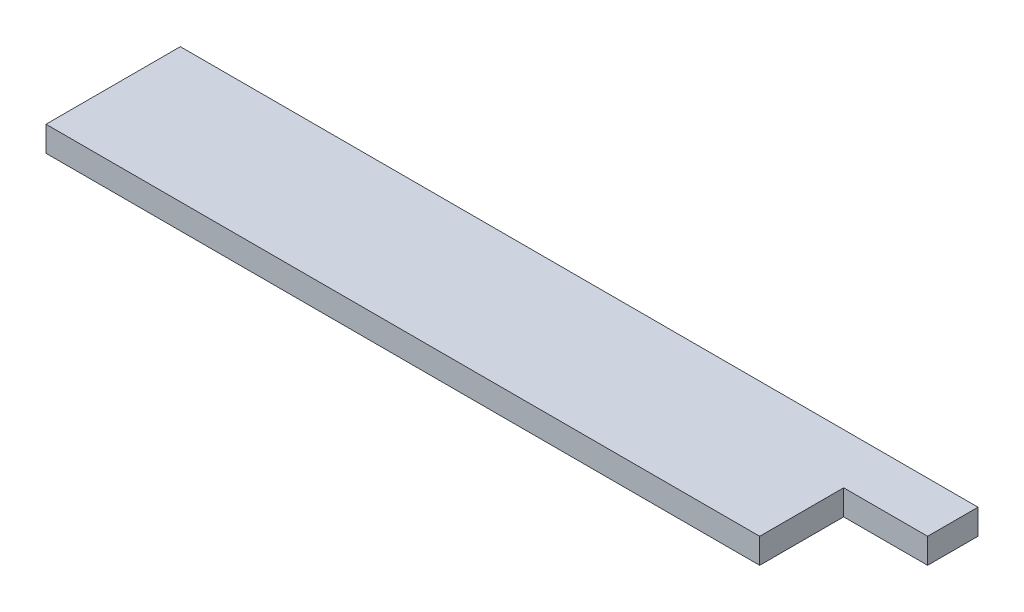
ISO-10303-21;
HEADER;
FILE_DESCRIPTION(('STEP AP214'),'2;1');
FILE_NAME('part.step','',(''),(''),'','','');
FILE_SCHEMA(('AUTOMOTIVE_DESIGN { 1 0 10303 214 1 1 1 1 }'));
ENDSEC;
DATA;
#1=APPLICATION_CONTEXT('core data for automotive mechanical design processes');
#2=APPLICATION_PROTOCOL_DEFINITION('international standard','automotive_design',2000,#1);
#3=PRODUCT_CONTEXT('',#1,'mechanical');
#4=PRODUCT('Part','Part','',(#3));
#5=PRODUCT_RELATED_PRODUCT_CATEGORY('part','',(#4));
#6=PRODUCT_DEFINITION_FORMATION('','',#4);
#7=PRODUCT_DEFINITION_CONTEXT('part definition',#1,'design');
#8=PRODUCT_DEFINITION('design','',#6,#7);
#9=PRODUCT_DEFINITION_SHAPE('','',#8);
#10=(LENGTH_UNIT() NAMED_UNIT(*) SI_UNIT(.MILLI.,.METRE.));
#11=(NAMED_UNIT(*) PLANE_ANGLE_UNIT() SI_UNIT($,.RADIAN.));
#12=(NAMED_UNIT(*) SI_UNIT($,.STERADIAN.) SOLID_ANGLE_UNIT());
#13=UNCERTAINTY_MEASURE_WITH_UNIT(LENGTH_MEASURE(1.E-05),#10,'distance_accuracy_value','');
#14=(GEOMETRIC_REPRESENTATION_CONTEXT(3) GLOBAL_UNCERTAINTY_ASSIGNED_CONTEXT((#13)) GLOBAL_UNIT_ASSIGNED_CONTEXT((#10,
#11,#12)) REPRESENTATION_CONTEXT('',''));
#15=CARTESIAN_POINT('',(0.,0.,0.));
#16=DIRECTION('',(0.,0.,1.));
#17=DIRECTION('',(1.,0.,0.));
#18=AXIS2_PLACEMENT_3D('',#15,#16,#17);
#19=CARTESIAN_POINT('',(47.5,3.,8.));
#20=DIRECTION('',(-1.,0.,0.));
#21=DIRECTION('',(0.,0.,1.));
#22=AXIS2_PLACEMENT_3D('',#19,#20,#21);
#23=PLANE('',#22);
#24=DIRECTION('',(0.,0.,-1.));
#25=VECTOR('',#24,1.);
#26=CARTESIAN_POINT('',(47.5,3.,8.));
#27=LINE('',#26,#25);
#28=CARTESIAN_POINT('',(47.5,3.,-2.));
#29=VERTEX_POINT('',#28);
#30=CARTESIAN_POINT('',(47.5,3.,-8.));
#31=VERTEX_POINT('',#30);
#32=EDGE_CURVE('E88',#29,#31,#27,.T.);
#33=ORIENTED_EDGE('',*,*,#32,.F.);
#34=DIRECTION('',(0.,1.,0.));
#35=VECTOR('',#34,1.);
#36=CARTESIAN_POINT('',(47.5,-7.,-2.));
#37=LINE('',#36,#35);
#38=CARTESIAN_POINT('',(47.5,0.,-2.));
#39=VERTEX_POINT('',#38);
#40=EDGE_CURVE('E103',#39,#29,#37,.T.);
#41=ORIENTED_EDGE('',*,*,#40,.F.);
#42=DIRECTION('',(0.,0.,-1.));
#43=VECTOR('',#42,1.);
#44=CARTESIAN_POINT('',(47.5,0.,8.));
#45=LINE('',#44,#43);
#46=CARTESIAN_POINT('',(47.5,0.,-8.));
#47=VERTEX_POINT('',#46);
#48=EDGE_CURVE('E136',#39,#47,#45,.T.);
#49=ORIENTED_EDGE('',*,*,#48,.T.);
#50=DIRECTION('',(0.,-1.,0.));
#51=VECTOR('',#50,1.);
#52=CARTESIAN_POINT('',(47.5,3.,-8.));
#53=LINE('',#52,#51);
#54=EDGE_CURVE('E118',#31,#47,#53,.T.);
#55=ORIENTED_EDGE('',*,*,#54,.F.);
#56=EDGE_LOOP('',(#33,#41,#49,#55));
#57=FACE_BOUND('',#56,.T.);
#58=ADVANCED_FACE('F43',(#57),#23,.F.);
#59=CARTESIAN_POINT('',(-47.5,3.,-8.));
#60=DIRECTION('',(0.,0.,1.));
#61=DIRECTION('',(1.,0.,0.));
#62=AXIS2_PLACEMENT_3D('',#59,#60,#61);
#63=PLANE('',#62);
#64=DIRECTION('',(-1.,0.,0.));
#65=VECTOR('',#64,1.);
#66=CARTESIAN_POINT('',(-47.5,0.,-8.));
#67=LINE('',#66,#65);
#68=CARTESIAN_POINT('',(-47.5,0.,-8.));
#69=VERTEX_POINT('',#68);
#70=EDGE_CURVE('E139',#47,#69,#67,.T.);
#71=ORIENTED_EDGE('',*,*,#70,.T.);
#72=DIRECTION('',(0.,-1.,0.));
#73=VECTOR('',#72,1.);
#74=CARTESIAN_POINT('',(-47.5,3.,-8.));
#75=LINE('',#74,#73);
#76=CARTESIAN_POINT('',(-47.5,3.,-8.));
#77=VERTEX_POINT('',#76);
#78=EDGE_CURVE('E147',#77,#69,#75,.T.);
#79=ORIENTED_EDGE('',*,*,#78,.F.);
#80=DIRECTION('',(-1.,0.,0.));
#81=VECTOR('',#80,1.);
#82=CARTESIAN_POINT('',(-47.5,3.,-8.));
#83=LINE('',#82,#81);
#84=EDGE_CURVE('E120',#31,#77,#83,.T.);
#85=ORIENTED_EDGE('',*,*,#84,.F.);
#86=ORIENTED_EDGE('',*,*,#54,.T.);
#87=EDGE_LOOP('',(#71,#79,#85,#86));
#88=FACE_BOUND('',#87,.T.);
#89=ADVANCED_FACE('F153',(#88),#63,.F.);
#90=CARTESIAN_POINT('',(-47.5,3.,8.));
#91=DIRECTION('',(1.,0.,0.));
#92=DIRECTION('',(0.,0.,-1.));
#93=AXIS2_PLACEMENT_3D('',#90,#91,#92);
#94=PLANE('',#93);
#95=DIRECTION('',(0.,0.,1.));
#96=VECTOR('',#95,1.);
#97=CARTESIAN_POINT('',(-47.5,0.,8.));
#98=LINE('',#97,#96);
#99=CARTESIAN_POINT('',(-47.5,0.,8.));
#100=VERTEX_POINT('',#99);
#101=EDGE_CURVE('E83',#69,#100,#98,.T.);
#102=ORIENTED_EDGE('',*,*,#101,.T.);
#103=DIRECTION('',(0.,-1.,0.));
#104=VECTOR('',#103,1.);
#105=CARTESIAN_POINT('',(-47.5,3.,8.));
#106=LINE('',#105,#104);
#107=CARTESIAN_POINT('',(-47.5,3.,8.));
#108=VERTEX_POINT('',#107);
#109=EDGE_CURVE('E135',#108,#100,#106,.T.);
#110=ORIENTED_EDGE('',*,*,#109,.F.);
#111=DIRECTION('',(0.,0.,1.));
#112=VECTOR('',#111,1.);
#113=CARTESIAN_POINT('',(-47.5,3.,8.));
#114=LINE('',#113,#112);
#115=EDGE_CURVE('E66',#77,#108,#114,.T.);
#116=ORIENTED_EDGE('',*,*,#115,.F.);
#117=ORIENTED_EDGE('',*,*,#78,.T.);
#118=EDGE_LOOP('',(#102,#110,#116,#117));
#119=FACE_BOUND('',#118,.T.);
#120=ADVANCED_FACE('F156',(#119),#94,.F.);
#121=CARTESIAN_POINT('',(-47.5,3.,8.));
#122=DIRECTION('',(0.,0.,-1.));
#123=DIRECTION('',(-1.,0.,0.));
#124=AXIS2_PLACEMENT_3D('',#121,#122,#123);
#125=PLANE('',#124);
#126=DIRECTION('',(1.,0.,0.));
#127=VECTOR('',#126,1.);
#128=CARTESIAN_POINT('',(-47.5,0.,8.));
#129=LINE('',#128,#127);
#130=CARTESIAN_POINT('',(37.5,0.,8.));
#131=VERTEX_POINT('',#130);
#132=EDGE_CURVE('E121',#100,#131,#129,.T.);
#133=ORIENTED_EDGE('',*,*,#132,.T.);
#134=DIRECTION('',(0.,1.,0.));
#135=VECTOR('',#134,1.);
#136=CARTESIAN_POINT('',(37.5,-7.,8.));
#137=LINE('',#136,#135);
#138=CARTESIAN_POINT('',(37.5,3.,8.));
#139=VERTEX_POINT('',#138);
#140=EDGE_CURVE('E140',#131,#139,#137,.T.);
#141=ORIENTED_EDGE('',*,*,#140,.T.);
#142=DIRECTION('',(1.,0.,0.));
#143=VECTOR('',#142,1.);
#144=CARTESIAN_POINT('',(-47.5,3.,8.));
#145=LINE('',#144,#143);
#146=EDGE_CURVE('E132',#108,#139,#145,.T.);
#147=ORIENTED_EDGE('',*,*,#146,.F.);
#148=ORIENTED_EDGE('',*,*,#109,.T.);
#149=EDGE_LOOP('',(#133,#141,#147,#148));
#150=FACE_BOUND('',#149,.T.);
#151=ADVANCED_FACE('F161',(#150),#125,.F.);
#152=CARTESIAN_POINT('',(0.,3.,0.));
#153=DIRECTION('',(0.,-1.,0.));
#154=DIRECTION('',(0.,0.,-1.));
#155=AXIS2_PLACEMENT_3D('',#152,#153,#154);
#156=PLANE('',#155);
#157=ORIENTED_EDGE('',*,*,#146,.T.);
#158=DIRECTION('',(0.,0.,1.));
#159=VECTOR('',#158,1.);
#160=CARTESIAN_POINT('',(37.5,3.,8.));
#161=LINE('',#160,#159);
#162=CARTESIAN_POINT('',(37.5,3.,-2.));
#163=VERTEX_POINT('',#162);
#164=EDGE_CURVE('E111',#163,#139,#161,.T.);
#165=ORIENTED_EDGE('',*,*,#164,.F.);
#166=DIRECTION('',(-1.,0.,0.));
#167=VECTOR('',#166,1.);
#168=CARTESIAN_POINT('',(47.5,3.,-2.));
#169=LINE('',#168,#167);
#170=EDGE_CURVE('E105',#29,#163,#169,.T.);
#171=ORIENTED_EDGE('',*,*,#170,.F.);
#172=ORIENTED_EDGE('',*,*,#32,.T.);
#173=ORIENTED_EDGE('',*,*,#84,.T.);
#174=ORIENTED_EDGE('',*,*,#115,.T.);
#175=EDGE_LOOP('',(#157,#165,#171,#172,#173,#174));
#176=FACE_BOUND('',#175,.T.);
#177=ADVANCED_FACE('F113',(#176),#156,.F.);
#178=CARTESIAN_POINT('',(0.,0.,0.));
#179=DIRECTION('',(0.,-1.,0.));
#180=DIRECTION('',(0.,0.,-1.));
#181=AXIS2_PLACEMENT_3D('',#178,#179,#180);
#182=PLANE('',#181);
#183=DIRECTION('',(0.,0.,-1.));
#184=VECTOR('',#183,1.);
#185=CARTESIAN_POINT('',(37.5,0.,0.));
#186=LINE('',#185,#184);
#187=CARTESIAN_POINT('',(37.5,0.,-2.));
#188=VERTEX_POINT('',#187);
#189=EDGE_CURVE('E11',#131,#188,#186,.T.);
#190=ORIENTED_EDGE('',*,*,#189,.F.);
#191=ORIENTED_EDGE('',*,*,#132,.F.);
#192=ORIENTED_EDGE('',*,*,#101,.F.);
#193=ORIENTED_EDGE('',*,*,#70,.F.);
#194=ORIENTED_EDGE('',*,*,#48,.F.);
#195=DIRECTION('',(1.,0.,0.));
#196=VECTOR('',#195,1.);
#197=CARTESIAN_POINT('',(0.,0.,-1.99999999999999));
#198=LINE('',#197,#196);
#199=EDGE_CURVE('E51',#188,#39,#198,.T.);
#200=ORIENTED_EDGE('',*,*,#199,.F.);
#201=EDGE_LOOP('',(#190,#191,#192,#193,#194,#200));
#202=FACE_BOUND('',#201,.T.);
#203=ADVANCED_FACE('F171',(#202),#182,.T.);
#204=CARTESIAN_POINT('',(37.5,-7.,8.));
#205=DIRECTION('',(-1.,0.,0.));
#206=DIRECTION('',(0.,0.,1.));
#207=AXIS2_PLACEMENT_3D('',#204,#205,#206);
#208=PLANE('',#207);
#209=ORIENTED_EDGE('',*,*,#189,.T.);
#210=DIRECTION('',(0.,1.,0.));
#211=VECTOR('',#210,1.);
#212=CARTESIAN_POINT('',(37.5,-7.,-2.));
#213=LINE('',#212,#211);
#214=EDGE_CURVE('E58',#188,#163,#213,.T.);
#215=ORIENTED_EDGE('',*,*,#214,.T.);
#216=ORIENTED_EDGE('',*,*,#164,.T.);
#217=ORIENTED_EDGE('',*,*,#140,.F.);
#218=EDGE_LOOP('',(#209,#215,#216,#217));
#219=FACE_BOUND('',#218,.T.);
#220=ADVANCED_FACE('F169',(#219),#208,.F.);
#221=CARTESIAN_POINT('',(47.5,-7.,-2.));
#222=DIRECTION('',(0.,0.,-1.));
#223=DIRECTION('',(-1.,0.,0.));
#224=AXIS2_PLACEMENT_3D('',#221,#222,#223);
#225=PLANE('',#224);
#226=ORIENTED_EDGE('',*,*,#199,.T.);
#227=ORIENTED_EDGE('',*,*,#40,.T.);
#228=ORIENTED_EDGE('',*,*,#170,.T.);
#229=ORIENTED_EDGE('',*,*,#214,.F.);
#230=EDGE_LOOP('',(#226,#227,#228,#229));
#231=FACE_BOUND('',#230,.T.);
#232=ADVANCED_FACE('F104',(#231),#225,.F.);
#233=CLOSED_SHELL('',(#58,#89,#120,#151,#177,#203,#220,#232));
#234=MANIFOLD_SOLID_BREP('B2',#233);
#235=ADVANCED_BREP_SHAPE_REPRESENTATION('',(#18,#234),#14);
#236=SHAPE_DEFINITION_REPRESENTATION(#9,#235);
ENDSEC;
END-ISO-10303-21;
